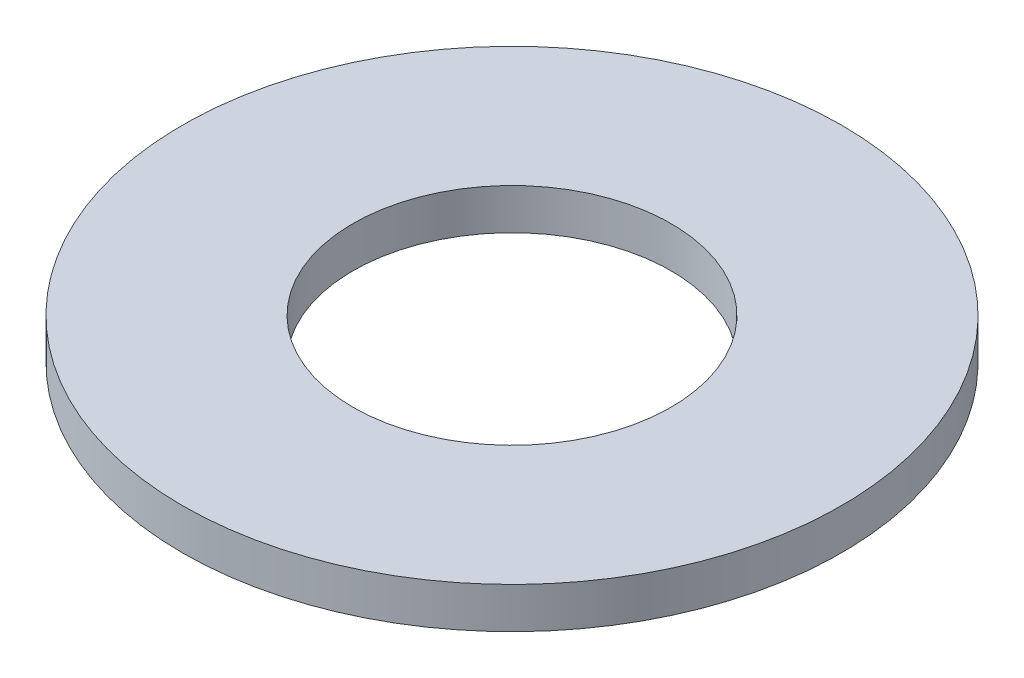
ISO-10303-21;
HEADER;
FILE_DESCRIPTION(('STEP AP214'),'2;1');
FILE_NAME('part.step','',(''),(''),'','','');
FILE_SCHEMA(('AUTOMOTIVE_DESIGN { 1 0 10303 214 1 1 1 1 }'));
ENDSEC;
DATA;
#1=APPLICATION_CONTEXT('core data for automotive mechanical design processes');
#2=APPLICATION_PROTOCOL_DEFINITION('international standard','automotive_design',2000,#1);
#3=PRODUCT_CONTEXT('',#1,'mechanical');
#4=PRODUCT('Part','Part','',(#3));
#5=PRODUCT_RELATED_PRODUCT_CATEGORY('part','',(#4));
#6=PRODUCT_DEFINITION_FORMATION('','',#4);
#7=PRODUCT_DEFINITION_CONTEXT('part definition',#1,'design');
#8=PRODUCT_DEFINITION('design','',#6,#7);
#9=PRODUCT_DEFINITION_SHAPE('','',#8);
#10=(LENGTH_UNIT() NAMED_UNIT(*) SI_UNIT(.MILLI.,.METRE.));
#11=(NAMED_UNIT(*) PLANE_ANGLE_UNIT() SI_UNIT($,.RADIAN.));
#12=(NAMED_UNIT(*) SI_UNIT($,.STERADIAN.) SOLID_ANGLE_UNIT());
#13=UNCERTAINTY_MEASURE_WITH_UNIT(LENGTH_MEASURE(1.E-05),#10,'distance_accuracy_value','');
#14=(GEOMETRIC_REPRESENTATION_CONTEXT(3) GLOBAL_UNCERTAINTY_ASSIGNED_CONTEXT((#13)) GLOBAL_UNIT_ASSIGNED_CONTEXT((#10,
#11,#12)) REPRESENTATION_CONTEXT('',''));
#15=CARTESIAN_POINT('',(0.,0.,0.));
#16=DIRECTION('',(0.,0.,1.));
#17=DIRECTION('',(1.,0.,0.));
#18=AXIS2_PLACEMENT_3D('',#15,#16,#17);
#19=CARTESIAN_POINT('',(0.,9.,0.));
#20=DIRECTION('',(0.,-1.,0.));
#21=DIRECTION('',(0.,0.,-1.));
#22=AXIS2_PLACEMENT_3D('',#19,#20,#21);
#23=CYLINDRICAL_SURFACE('',#22,72.5);
#24=CARTESIAN_POINT('',(0.,9.,0.));
#25=DIRECTION('',(0.,1.,0.));
#26=DIRECTION('',(0.,0.,1.));
#27=AXIS2_PLACEMENT_3D('',#24,#25,#26);
#28=CIRCLE('',#27,72.5);
#29=CARTESIAN_POINT('',(0.,9.,72.5));
#30=VERTEX_POINT('',#29);
#31=EDGE_CURVE('E10',#30,#30,#28,.T.);
#32=ORIENTED_EDGE('',*,*,#31,.F.);
#33=EDGE_LOOP('',(#32));
#34=FACE_BOUND('',#33,.T.);
#35=CARTESIAN_POINT('',(0.,0.,0.));
#36=DIRECTION('',(0.,1.,0.));
#37=DIRECTION('',(0.,0.,1.));
#38=AXIS2_PLACEMENT_3D('',#35,#36,#37);
#39=CIRCLE('',#38,72.5);
#40=CARTESIAN_POINT('',(0.,0.,72.5));
#41=VERTEX_POINT('',#40);
#42=EDGE_CURVE('E37',#41,#41,#39,.T.);
#43=ORIENTED_EDGE('',*,*,#42,.T.);
#44=EDGE_LOOP('',(#43));
#45=FACE_BOUND('',#44,.T.);
#46=ADVANCED_FACE('F40',(#34,#45),#23,.T.);
#47=CARTESIAN_POINT('',(0.,9.,0.));
#48=DIRECTION('',(0.,1.,0.));
#49=DIRECTION('',(0.,0.,1.));
#50=AXIS2_PLACEMENT_3D('',#47,#48,#49);
#51=PLANE('',#50);
#52=CARTESIAN_POINT('',(0.,9.,0.));
#53=DIRECTION('',(0.,1.,0.));
#54=DIRECTION('',(0.,0.,1.));
#55=AXIS2_PLACEMENT_3D('',#52,#53,#54);
#56=CIRCLE('',#55,35.);
#57=CARTESIAN_POINT('',(0.,9.,35.));
#58=VERTEX_POINT('',#57);
#59=EDGE_CURVE('E50',#58,#58,#56,.T.);
#60=ORIENTED_EDGE('',*,*,#59,.F.);
#61=EDGE_LOOP('',(#60));
#62=FACE_BOUND('',#61,.T.);
#63=ORIENTED_EDGE('',*,*,#31,.T.);
#64=EDGE_LOOP('',(#63));
#65=FACE_BOUND('',#64,.T.);
#66=ADVANCED_FACE('F59',(#62,#65),#51,.T.);
#67=CARTESIAN_POINT('',(0.,0.,0.));
#68=DIRECTION('',(0.,1.,0.));
#69=DIRECTION('',(0.,0.,1.));
#70=AXIS2_PLACEMENT_3D('',#67,#68,#69);
#71=PLANE('',#70);
#72=CARTESIAN_POINT('',(0.,0.,0.));
#73=DIRECTION('',(0.,1.,0.));
#74=DIRECTION('',(0.,0.,1.));
#75=AXIS2_PLACEMENT_3D('',#72,#73,#74);
#76=CIRCLE('',#75,35.);
#77=CARTESIAN_POINT('',(0.,0.,35.));
#78=VERTEX_POINT('',#77);
#79=EDGE_CURVE('E47',#78,#78,#76,.T.);
#80=ORIENTED_EDGE('',*,*,#79,.T.);
#81=EDGE_LOOP('',(#80));
#82=FACE_BOUND('',#81,.T.);
#83=ORIENTED_EDGE('',*,*,#42,.F.);
#84=EDGE_LOOP('',(#83));
#85=FACE_BOUND('',#84,.T.);
#86=ADVANCED_FACE('F58',(#82,#85),#71,.F.);
#87=CARTESIAN_POINT('',(0.,9.,0.));
#88=DIRECTION('',(0.,-1.,0.));
#89=DIRECTION('',(0.,0.,-1.));
#90=AXIS2_PLACEMENT_3D('',#87,#88,#89);
#91=CYLINDRICAL_SURFACE('',#90,35.);
#92=ORIENTED_EDGE('',*,*,#59,.T.);
#93=EDGE_LOOP('',(#92));
#94=FACE_BOUND('',#93,.T.);
#95=ORIENTED_EDGE('',*,*,#79,.F.);
#96=EDGE_LOOP('',(#95));
#97=FACE_BOUND('',#96,.T.);
#98=ADVANCED_FACE('F54',(#94,#97),#91,.F.);
#99=CLOSED_SHELL('',(#46,#66,#86,#98));
#100=MANIFOLD_SOLID_BREP('B2',#99);
#101=ADVANCED_BREP_SHAPE_REPRESENTATION('',(#18,#100),#14);
#102=SHAPE_DEFINITION_REPRESENTATION(#9,#101);
ENDSEC;
END-ISO-10303-21;
